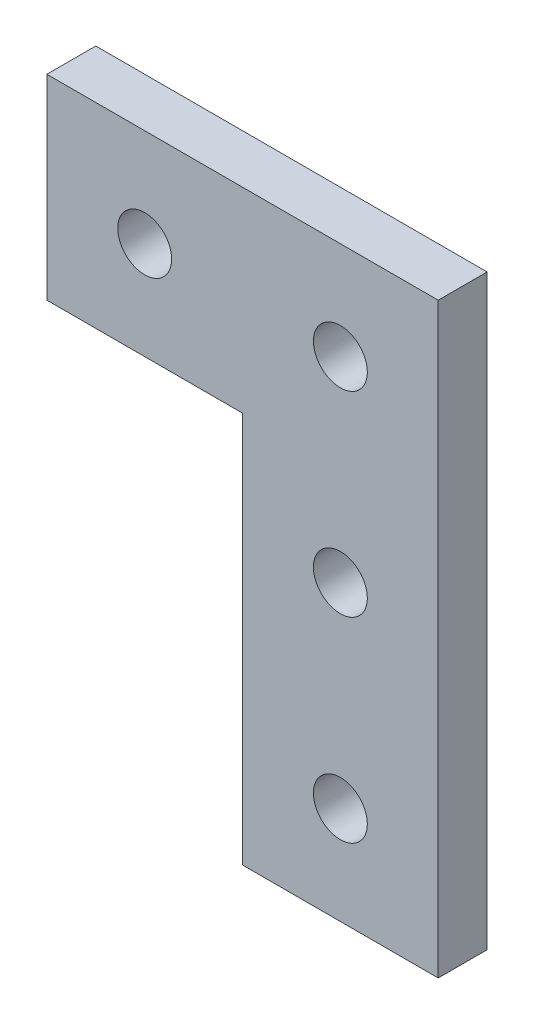
ISO-10303-21;
HEADER;
FILE_DESCRIPTION(('STEP AP214'),'2;1');
FILE_NAME('part.step','',(''),(''),'','','');
FILE_SCHEMA(('AUTOMOTIVE_DESIGN { 1 0 10303 214 1 1 1 1 }'));
ENDSEC;
DATA;
#1=APPLICATION_CONTEXT('core data for automotive mechanical design processes');
#2=APPLICATION_PROTOCOL_DEFINITION('international standard','automotive_design',2000,#1);
#3=PRODUCT_CONTEXT('',#1,'mechanical');
#4=PRODUCT('Part','Part','',(#3));
#5=PRODUCT_RELATED_PRODUCT_CATEGORY('part','',(#4));
#6=PRODUCT_DEFINITION_FORMATION('','',#4);
#7=PRODUCT_DEFINITION_CONTEXT('part definition',#1,'design');
#8=PRODUCT_DEFINITION('design','',#6,#7);
#9=PRODUCT_DEFINITION_SHAPE('','',#8);
#10=(LENGTH_UNIT() NAMED_UNIT(*) SI_UNIT(.MILLI.,.METRE.));
#11=(NAMED_UNIT(*) PLANE_ANGLE_UNIT() SI_UNIT($,.RADIAN.));
#12=(NAMED_UNIT(*) SI_UNIT($,.STERADIAN.) SOLID_ANGLE_UNIT());
#13=UNCERTAINTY_MEASURE_WITH_UNIT(LENGTH_MEASURE(1.E-05),#10,'distance_accuracy_value','');
#14=(GEOMETRIC_REPRESENTATION_CONTEXT(3) GLOBAL_UNCERTAINTY_ASSIGNED_CONTEXT((#13)) GLOBAL_UNIT_ASSIGNED_CONTEXT((#10,
#11,#12)) REPRESENTATION_CONTEXT('',''));
#15=CARTESIAN_POINT('',(0.,0.,0.));
#16=DIRECTION('',(0.,0.,1.));
#17=DIRECTION('',(1.,0.,0.));
#18=AXIS2_PLACEMENT_3D('',#15,#16,#17);
#19=CARTESIAN_POINT('',(12.7,76.2,6.35));
#20=DIRECTION('',(0.,-1.,0.));
#21=DIRECTION('',(0.,0.,-1.));
#22=AXIS2_PLACEMENT_3D('',#19,#20,#21);
#23=PLANE('',#22);
#24=DIRECTION('',(0.,0.,-1.));
#25=VECTOR('',#24,1.);
#26=CARTESIAN_POINT('',(-38.1,76.2,6.35));
#27=LINE('',#26,#25);
#28=CARTESIAN_POINT('',(-38.1,76.2,6.35));
#29=VERTEX_POINT('',#28);
#30=CARTESIAN_POINT('',(-38.1,76.2,0.));
#31=VERTEX_POINT('',#30);
#32=EDGE_CURVE('E50',#29,#31,#27,.T.);
#33=ORIENTED_EDGE('',*,*,#32,.F.);
#34=DIRECTION('',(-1.,0.,0.));
#35=VECTOR('',#34,1.);
#36=CARTESIAN_POINT('',(12.7,76.2,6.35));
#37=LINE('',#36,#35);
#38=CARTESIAN_POINT('',(12.7,76.2,6.35));
#39=VERTEX_POINT('',#38);
#40=EDGE_CURVE('E128',#39,#29,#37,.T.);
#41=ORIENTED_EDGE('',*,*,#40,.F.);
#42=DIRECTION('',(0.,0.,-1.));
#43=VECTOR('',#42,1.);
#44=CARTESIAN_POINT('',(12.7,76.2,6.35));
#45=LINE('',#44,#43);
#46=CARTESIAN_POINT('',(12.7,76.2,0.));
#47=VERTEX_POINT('',#46);
#48=EDGE_CURVE('E43',#39,#47,#45,.T.);
#49=ORIENTED_EDGE('',*,*,#48,.T.);
#50=DIRECTION('',(-1.,0.,0.));
#51=VECTOR('',#50,1.);
#52=CARTESIAN_POINT('',(12.7,76.2,0.));
#53=LINE('',#52,#51);
#54=EDGE_CURVE('E110',#47,#31,#53,.T.);
#55=ORIENTED_EDGE('',*,*,#54,.T.);
#56=EDGE_LOOP('',(#33,#41,#49,#55));
#57=FACE_BOUND('',#56,.T.);
#58=ADVANCED_FACE('F35',(#57),#23,.F.);
#59=CARTESIAN_POINT('',(-63.1,50.8,6.35));
#60=DIRECTION('',(0.,1.,0.));
#61=DIRECTION('',(0.,0.,1.));
#62=AXIS2_PLACEMENT_3D('',#59,#60,#61);
#63=PLANE('',#62);
#64=DIRECTION('',(0.,0.,1.));
#65=VECTOR('',#64,1.);
#66=CARTESIAN_POINT('',(-38.1,50.8,6.35));
#67=LINE('',#66,#65);
#68=CARTESIAN_POINT('',(-38.1,50.8,0.));
#69=VERTEX_POINT('',#68);
#70=CARTESIAN_POINT('',(-38.1,50.8,6.35));
#71=VERTEX_POINT('',#70);
#72=EDGE_CURVE('E95',#69,#71,#67,.T.);
#73=ORIENTED_EDGE('',*,*,#72,.F.);
#74=DIRECTION('',(1.,0.,0.));
#75=VECTOR('',#74,1.);
#76=CARTESIAN_POINT('',(-63.1,50.8,0.));
#77=LINE('',#76,#75);
#78=CARTESIAN_POINT('',(-12.7,50.8,0.));
#79=VERTEX_POINT('',#78);
#80=EDGE_CURVE('E103',#69,#79,#77,.T.);
#81=ORIENTED_EDGE('',*,*,#80,.T.);
#82=DIRECTION('',(0.,0.,-1.));
#83=VECTOR('',#82,1.);
#84=CARTESIAN_POINT('',(-12.7,50.8,6.35));
#85=LINE('',#84,#83);
#86=CARTESIAN_POINT('',(-12.7,50.8,6.35));
#87=VERTEX_POINT('',#86);
#88=EDGE_CURVE('E124',#87,#79,#85,.T.);
#89=ORIENTED_EDGE('',*,*,#88,.F.);
#90=DIRECTION('',(1.,0.,0.));
#91=VECTOR('',#90,1.);
#92=CARTESIAN_POINT('',(-63.1,50.8,6.35));
#93=LINE('',#92,#91);
#94=EDGE_CURVE('E105',#71,#87,#93,.T.);
#95=ORIENTED_EDGE('',*,*,#94,.F.);
#96=EDGE_LOOP('',(#73,#81,#89,#95));
#97=FACE_BOUND('',#96,.T.);
#98=ADVANCED_FACE('F101',(#97),#63,.F.);
#99=CARTESIAN_POINT('',(0.,0.,6.35));
#100=DIRECTION('',(0.,0.,-1.));
#101=DIRECTION('',(-1.,0.,0.));
#102=AXIS2_PLACEMENT_3D('',#99,#100,#101);
#103=PLANE('',#102);
#104=CARTESIAN_POINT('',(0.,12.7,6.35));
#105=DIRECTION('',(0.,0.,1.));
#106=DIRECTION('',(1.,0.,0.));
#107=AXIS2_PLACEMENT_3D('',#104,#105,#106);
#108=CIRCLE('',#107,3.5);
#109=CARTESIAN_POINT('',(3.5,12.7,6.35));
#110=VERTEX_POINT('',#109);
#111=EDGE_CURVE('E141',#110,#110,#108,.T.);
#112=ORIENTED_EDGE('',*,*,#111,.F.);
#113=EDGE_LOOP('',(#112));
#114=FACE_BOUND('',#113,.T.);
#115=CARTESIAN_POINT('',(0.,38.1,6.35));
#116=DIRECTION('',(0.,0.,1.));
#117=DIRECTION('',(1.,0.,0.));
#118=AXIS2_PLACEMENT_3D('',#115,#116,#117);
#119=CIRCLE('',#118,3.5);
#120=CARTESIAN_POINT('',(3.5,38.1,6.35));
#121=VERTEX_POINT('',#120);
#122=EDGE_CURVE('E148',#121,#121,#119,.T.);
#123=ORIENTED_EDGE('',*,*,#122,.F.);
#124=EDGE_LOOP('',(#123));
#125=FACE_BOUND('',#124,.T.);
#126=CARTESIAN_POINT('',(-25.4,63.5,6.35));
#127=DIRECTION('',(0.,0.,1.));
#128=DIRECTION('',(1.,0.,0.));
#129=AXIS2_PLACEMENT_3D('',#126,#127,#128);
#130=CIRCLE('',#129,3.5);
#131=CARTESIAN_POINT('',(-21.9,63.5,6.35));
#132=VERTEX_POINT('',#131);
#133=EDGE_CURVE('E154',#132,#132,#130,.T.);
#134=ORIENTED_EDGE('',*,*,#133,.F.);
#135=EDGE_LOOP('',(#134));
#136=FACE_BOUND('',#135,.T.);
#137=CARTESIAN_POINT('',(0.,63.5,6.35));
#138=DIRECTION('',(0.,0.,1.));
#139=DIRECTION('',(1.,0.,0.));
#140=AXIS2_PLACEMENT_3D('',#137,#138,#139);
#141=CIRCLE('',#140,3.5);
#142=CARTESIAN_POINT('',(3.5,63.5,6.35));
#143=VERTEX_POINT('',#142);
#144=EDGE_CURVE('E132',#143,#143,#141,.T.);
#145=ORIENTED_EDGE('',*,*,#144,.F.);
#146=EDGE_LOOP('',(#145));
#147=FACE_BOUND('',#146,.T.);
#148=DIRECTION('',(0.,1.,0.));
#149=VECTOR('',#148,1.);
#150=CARTESIAN_POINT('',(-38.1,0.,6.35));
#151=LINE('',#150,#149);
#152=EDGE_CURVE('E145',#71,#29,#151,.T.);
#153=ORIENTED_EDGE('',*,*,#152,.F.);
#154=ORIENTED_EDGE('',*,*,#94,.T.);
#155=DIRECTION('',(0.,-1.,0.));
#156=VECTOR('',#155,1.);
#157=CARTESIAN_POINT('',(-12.7,0.,6.35));
#158=LINE('',#157,#156);
#159=CARTESIAN_POINT('',(-12.7,0.,6.35));
#160=VERTEX_POINT('',#159);
#161=EDGE_CURVE('E136',#87,#160,#158,.T.);
#162=ORIENTED_EDGE('',*,*,#161,.T.);
#163=DIRECTION('',(1.,0.,0.));
#164=VECTOR('',#163,1.);
#165=CARTESIAN_POINT('',(12.7,0.,6.35));
#166=LINE('',#165,#164);
#167=CARTESIAN_POINT('',(12.7,0.,6.35));
#168=VERTEX_POINT('',#167);
#169=EDGE_CURVE('E58',#160,#168,#166,.T.);
#170=ORIENTED_EDGE('',*,*,#169,.T.);
#171=DIRECTION('',(0.,1.,0.));
#172=VECTOR('',#171,1.);
#173=CARTESIAN_POINT('',(12.7,50.8,6.35));
#174=LINE('',#173,#172);
#175=EDGE_CURVE('E84',#168,#39,#174,.T.);
#176=ORIENTED_EDGE('',*,*,#175,.T.);
#177=ORIENTED_EDGE('',*,*,#40,.T.);
#178=EDGE_LOOP('',(#153,#154,#162,#170,#176,#177));
#179=FACE_BOUND('',#178,.T.);
#180=ADVANCED_FACE('F163',(#114,#125,#136,#147,#179),#103,.F.);
#181=CARTESIAN_POINT('',(0.,0.,0.));
#182=DIRECTION('',(0.,0.,-1.));
#183=DIRECTION('',(-1.,0.,0.));
#184=AXIS2_PLACEMENT_3D('',#181,#182,#183);
#185=PLANE('',#184);
#186=CARTESIAN_POINT('',(0.,12.7,0.));
#187=DIRECTION('',(0.,0.,1.));
#188=DIRECTION('',(1.,0.,0.));
#189=AXIS2_PLACEMENT_3D('',#186,#187,#188);
#190=CIRCLE('',#189,3.5);
#191=CARTESIAN_POINT('',(3.5,12.7,0.));
#192=VERTEX_POINT('',#191);
#193=EDGE_CURVE('E144',#192,#192,#190,.T.);
#194=ORIENTED_EDGE('',*,*,#193,.T.);
#195=EDGE_LOOP('',(#194));
#196=FACE_BOUND('',#195,.T.);
#197=CARTESIAN_POINT('',(0.,38.1,0.));
#198=DIRECTION('',(0.,0.,1.));
#199=DIRECTION('',(1.,0.,0.));
#200=AXIS2_PLACEMENT_3D('',#197,#198,#199);
#201=CIRCLE('',#200,3.5);
#202=CARTESIAN_POINT('',(3.5,38.1,0.));
#203=VERTEX_POINT('',#202);
#204=EDGE_CURVE('E151',#203,#203,#201,.T.);
#205=ORIENTED_EDGE('',*,*,#204,.T.);
#206=EDGE_LOOP('',(#205));
#207=FACE_BOUND('',#206,.T.);
#208=CARTESIAN_POINT('',(-25.4,63.5,0.));
#209=DIRECTION('',(0.,0.,1.));
#210=DIRECTION('',(1.,0.,0.));
#211=AXIS2_PLACEMENT_3D('',#208,#209,#210);
#212=CIRCLE('',#211,3.5);
#213=CARTESIAN_POINT('',(-21.9,63.5,0.));
#214=VERTEX_POINT('',#213);
#215=EDGE_CURVE('E157',#214,#214,#212,.T.);
#216=ORIENTED_EDGE('',*,*,#215,.T.);
#217=EDGE_LOOP('',(#216));
#218=FACE_BOUND('',#217,.T.);
#219=CARTESIAN_POINT('',(0.,63.5,0.));
#220=DIRECTION('',(0.,0.,1.));
#221=DIRECTION('',(1.,0.,0.));
#222=AXIS2_PLACEMENT_3D('',#219,#220,#221);
#223=CIRCLE('',#222,3.5);
#224=CARTESIAN_POINT('',(3.5,63.5,0.));
#225=VERTEX_POINT('',#224);
#226=EDGE_CURVE('E130',#225,#225,#223,.T.);
#227=ORIENTED_EDGE('',*,*,#226,.T.);
#228=EDGE_LOOP('',(#227));
#229=FACE_BOUND('',#228,.T.);
#230=ORIENTED_EDGE('',*,*,#80,.F.);
#231=DIRECTION('',(0.,1.,0.));
#232=VECTOR('',#231,1.);
#233=CARTESIAN_POINT('',(-38.1,0.,0.));
#234=LINE('',#233,#232);
#235=EDGE_CURVE('E11',#69,#31,#234,.T.);
#236=ORIENTED_EDGE('',*,*,#235,.T.);
#237=ORIENTED_EDGE('',*,*,#54,.F.);
#238=DIRECTION('',(0.,1.,0.));
#239=VECTOR('',#238,1.);
#240=CARTESIAN_POINT('',(12.7,50.8,0.));
#241=LINE('',#240,#239);
#242=CARTESIAN_POINT('',(12.7,0.,0.));
#243=VERTEX_POINT('',#242);
#244=EDGE_CURVE('E79',#243,#47,#241,.T.);
#245=ORIENTED_EDGE('',*,*,#244,.F.);
#246=DIRECTION('',(1.,0.,0.));
#247=VECTOR('',#246,1.);
#248=CARTESIAN_POINT('',(12.7,0.,0.));
#249=LINE('',#248,#247);
#250=CARTESIAN_POINT('',(-12.7,0.,0.));
#251=VERTEX_POINT('',#250);
#252=EDGE_CURVE('E112',#251,#243,#249,.T.);
#253=ORIENTED_EDGE('',*,*,#252,.F.);
#254=DIRECTION('',(0.,-1.,0.));
#255=VECTOR('',#254,1.);
#256=CARTESIAN_POINT('',(-12.7,0.,0.));
#257=LINE('',#256,#255);
#258=EDGE_CURVE('E109',#79,#251,#257,.T.);
#259=ORIENTED_EDGE('',*,*,#258,.F.);
#260=EDGE_LOOP('',(#230,#236,#237,#245,#253,#259));
#261=FACE_BOUND('',#260,.T.);
#262=ADVANCED_FACE('F108',(#196,#207,#218,#229,#261),#185,.T.);
#263=CARTESIAN_POINT('',(12.7,50.8,6.35));
#264=DIRECTION('',(-1.,0.,0.));
#265=DIRECTION('',(0.,0.,1.));
#266=AXIS2_PLACEMENT_3D('',#263,#264,#265);
#267=PLANE('',#266);
#268=ORIENTED_EDGE('',*,*,#244,.T.);
#269=ORIENTED_EDGE('',*,*,#48,.F.);
#270=ORIENTED_EDGE('',*,*,#175,.F.);
#271=DIRECTION('',(0.,0.,-1.));
#272=VECTOR('',#271,1.);
#273=CARTESIAN_POINT('',(12.7,0.,6.35));
#274=LINE('',#273,#272);
#275=EDGE_CURVE('E118',#168,#243,#274,.T.);
#276=ORIENTED_EDGE('',*,*,#275,.T.);
#277=EDGE_LOOP('',(#268,#269,#270,#276));
#278=FACE_BOUND('',#277,.T.);
#279=ADVANCED_FACE('F37',(#278),#267,.F.);
#280=CARTESIAN_POINT('',(-12.7,0.,6.35));
#281=DIRECTION('',(1.,0.,0.));
#282=DIRECTION('',(0.,0.,-1.));
#283=AXIS2_PLACEMENT_3D('',#280,#281,#282);
#284=PLANE('',#283);
#285=ORIENTED_EDGE('',*,*,#258,.T.);
#286=DIRECTION('',(0.,0.,-1.));
#287=VECTOR('',#286,1.);
#288=CARTESIAN_POINT('',(-12.7,0.,6.35));
#289=LINE('',#288,#287);
#290=EDGE_CURVE('E121',#160,#251,#289,.T.);
#291=ORIENTED_EDGE('',*,*,#290,.F.);
#292=ORIENTED_EDGE('',*,*,#161,.F.);
#293=ORIENTED_EDGE('',*,*,#88,.T.);
#294=EDGE_LOOP('',(#285,#291,#292,#293));
#295=FACE_BOUND('',#294,.T.);
#296=ADVANCED_FACE('F182',(#295),#284,.F.);
#297=CARTESIAN_POINT('',(12.7,0.,6.35));
#298=DIRECTION('',(0.,1.,0.));
#299=DIRECTION('',(-1.,0.,0.));
#300=AXIS2_PLACEMENT_3D('',#297,#298,#299);
#301=PLANE('',#300);
#302=ORIENTED_EDGE('',*,*,#252,.T.);
#303=ORIENTED_EDGE('',*,*,#275,.F.);
#304=ORIENTED_EDGE('',*,*,#169,.F.);
#305=ORIENTED_EDGE('',*,*,#290,.T.);
#306=EDGE_LOOP('',(#302,#303,#304,#305));
#307=FACE_BOUND('',#306,.T.);
#308=ADVANCED_FACE('F185',(#307),#301,.F.);
#309=CARTESIAN_POINT('',(0.,12.7,0.));
#310=DIRECTION('',(0.,0.,1.));
#311=DIRECTION('',(1.,0.,0.));
#312=AXIS2_PLACEMENT_3D('',#309,#310,#311);
#313=CYLINDRICAL_SURFACE('',#312,3.5);
#314=ORIENTED_EDGE('',*,*,#193,.F.);
#315=EDGE_LOOP('',(#314));
#316=FACE_BOUND('',#315,.T.);
#317=ORIENTED_EDGE('',*,*,#111,.T.);
#318=EDGE_LOOP('',(#317));
#319=FACE_BOUND('',#318,.T.);
#320=ADVANCED_FACE('F188',(#316,#319),#313,.F.);
#321=CARTESIAN_POINT('',(0.,38.1,0.));
#322=DIRECTION('',(0.,0.,1.));
#323=DIRECTION('',(1.,0.,0.));
#324=AXIS2_PLACEMENT_3D('',#321,#322,#323);
#325=CYLINDRICAL_SURFACE('',#324,3.5);
#326=ORIENTED_EDGE('',*,*,#204,.F.);
#327=EDGE_LOOP('',(#326));
#328=FACE_BOUND('',#327,.T.);
#329=ORIENTED_EDGE('',*,*,#122,.T.);
#330=EDGE_LOOP('',(#329));
#331=FACE_BOUND('',#330,.T.);
#332=ADVANCED_FACE('F193',(#328,#331),#325,.F.);
#333=CARTESIAN_POINT('',(-25.4,63.5,0.));
#334=DIRECTION('',(0.,0.,1.));
#335=DIRECTION('',(1.,0.,0.));
#336=AXIS2_PLACEMENT_3D('',#333,#334,#335);
#337=CYLINDRICAL_SURFACE('',#336,3.5);
#338=ORIENTED_EDGE('',*,*,#215,.F.);
#339=EDGE_LOOP('',(#338));
#340=FACE_BOUND('',#339,.T.);
#341=ORIENTED_EDGE('',*,*,#133,.T.);
#342=EDGE_LOOP('',(#341));
#343=FACE_BOUND('',#342,.T.);
#344=ADVANCED_FACE('F200',(#340,#343),#337,.F.);
#345=CARTESIAN_POINT('',(0.,63.5,0.));
#346=DIRECTION('',(0.,0.,1.));
#347=DIRECTION('',(1.,0.,0.));
#348=AXIS2_PLACEMENT_3D('',#345,#346,#347);
#349=CYLINDRICAL_SURFACE('',#348,3.5);
#350=ORIENTED_EDGE('',*,*,#226,.F.);
#351=EDGE_LOOP('',(#350));
#352=FACE_BOUND('',#351,.T.);
#353=ORIENTED_EDGE('',*,*,#144,.T.);
#354=EDGE_LOOP('',(#353));
#355=FACE_BOUND('',#354,.T.);
#356=ADVANCED_FACE('F208',(#352,#355),#349,.F.);
#357=CARTESIAN_POINT('',(-38.1,0.,0.));
#358=DIRECTION('',(-1.,0.,0.));
#359=DIRECTION('',(0.,0.,1.));
#360=AXIS2_PLACEMENT_3D('',#357,#358,#359);
#361=PLANE('',#360);
#362=ORIENTED_EDGE('',*,*,#152,.T.);
#363=ORIENTED_EDGE('',*,*,#32,.T.);
#364=ORIENTED_EDGE('',*,*,#235,.F.);
#365=ORIENTED_EDGE('',*,*,#72,.T.);
#366=EDGE_LOOP('',(#362,#363,#364,#365));
#367=FACE_BOUND('',#366,.T.);
#368=ADVANCED_FACE('F94',(#367),#361,.T.);
#369=CLOSED_SHELL('',(#58,#98,#180,#262,#279,#296,#308,#320,#332,#344,#356,#368));
#370=MANIFOLD_SOLID_BREP('B2',#369);
#371=ADVANCED_BREP_SHAPE_REPRESENTATION('',(#18,#370),#14);
#372=SHAPE_DEFINITION_REPRESENTATION(#9,#371);
ENDSEC;
END-ISO-10303-21;
